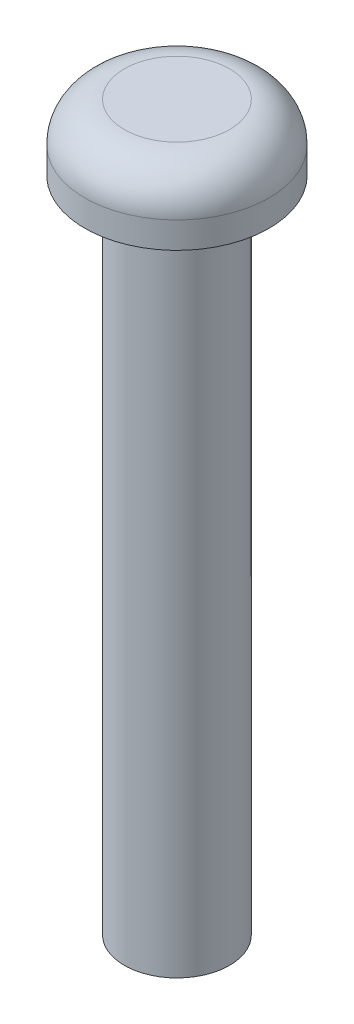
ISO-10303-21;
HEADER;
FILE_DESCRIPTION(('STEP AP214'),'2;1');
FILE_NAME('part.step','',(''),(''),'','','');
FILE_SCHEMA(('AUTOMOTIVE_DESIGN { 1 0 10303 214 1 1 1 1 }'));
ENDSEC;
DATA;
#1=APPLICATION_CONTEXT('core data for automotive mechanical design processes');
#2=APPLICATION_PROTOCOL_DEFINITION('international standard','automotive_design',2000,#1);
#3=PRODUCT_CONTEXT('',#1,'mechanical');
#4=PRODUCT('Part','Part','',(#3));
#5=PRODUCT_RELATED_PRODUCT_CATEGORY('part','',(#4));
#6=PRODUCT_DEFINITION_FORMATION('','',#4);
#7=PRODUCT_DEFINITION_CONTEXT('part definition',#1,'design');
#8=PRODUCT_DEFINITION('design','',#6,#7);
#9=PRODUCT_DEFINITION_SHAPE('','',#8);
#10=(LENGTH_UNIT() NAMED_UNIT(*) SI_UNIT(.MILLI.,.METRE.));
#11=(NAMED_UNIT(*) PLANE_ANGLE_UNIT() SI_UNIT($,.RADIAN.));
#12=(NAMED_UNIT(*) SI_UNIT($,.STERADIAN.) SOLID_ANGLE_UNIT());
#13=UNCERTAINTY_MEASURE_WITH_UNIT(LENGTH_MEASURE(1.E-05),#10,'distance_accuracy_value','');
#14=(GEOMETRIC_REPRESENTATION_CONTEXT(3) GLOBAL_UNCERTAINTY_ASSIGNED_CONTEXT((#13)) GLOBAL_UNIT_ASSIGNED_CONTEXT((#10,
#11,#12)) REPRESENTATION_CONTEXT('',''));
#15=CARTESIAN_POINT('',(0.,0.,0.));
#16=DIRECTION('',(0.,0.,1.));
#17=DIRECTION('',(1.,0.,0.));
#18=AXIS2_PLACEMENT_3D('',#15,#16,#17);
#19=CARTESIAN_POINT('',(0.,-25.,0.));
#20=DIRECTION('',(0.,-1.,0.));
#21=DIRECTION('',(0.,0.,-1.));
#22=AXIS2_PLACEMENT_3D('',#19,#20,#21);
#23=CYLINDRICAL_SURFACE('',#22,2.);
#24=CARTESIAN_POINT('',(0.,0.,0.));
#25=DIRECTION('',(0.,-1.,0.));
#26=DIRECTION('',(0.,0.,-1.));
#27=AXIS2_PLACEMENT_3D('',#24,#25,#26);
#28=CIRCLE('',#27,2.);
#29=CARTESIAN_POINT('',(0.,0.,-2.));
#30=VERTEX_POINT('',#29);
#31=EDGE_CURVE('E10',#30,#30,#28,.T.);
#32=ORIENTED_EDGE('',*,*,#31,.T.);
#33=EDGE_LOOP('',(#32));
#34=FACE_BOUND('',#33,.T.);
#35=CARTESIAN_POINT('',(0.,-25.,0.));
#36=DIRECTION('',(0.,-1.,0.));
#37=DIRECTION('',(0.,0.,-1.));
#38=AXIS2_PLACEMENT_3D('',#35,#36,#37);
#39=CIRCLE('',#38,2.);
#40=CARTESIAN_POINT('',(0.,-25.,-2.));
#41=VERTEX_POINT('',#40);
#42=EDGE_CURVE('E53',#41,#41,#39,.T.);
#43=ORIENTED_EDGE('',*,*,#42,.F.);
#44=EDGE_LOOP('',(#43));
#45=FACE_BOUND('',#44,.T.);
#46=ADVANCED_FACE('F34',(#34,#45),#23,.T.);
#47=CARTESIAN_POINT('',(2.,0.,0.));
#48=DIRECTION('',(0.,-1.,0.));
#49=DIRECTION('',(0.,0.,-1.));
#50=AXIS2_PLACEMENT_3D('',#47,#48,#49);
#51=PLANE('',#50);
#52=CARTESIAN_POINT('',(0.,0.,0.));
#53=DIRECTION('',(0.,-1.,0.));
#54=DIRECTION('',(0.,0.,-1.));
#55=AXIS2_PLACEMENT_3D('',#52,#53,#54);
#56=CIRCLE('',#55,3.5);
#57=CARTESIAN_POINT('',(0.,0.,-3.5));
#58=VERTEX_POINT('',#57);
#59=EDGE_CURVE('E40',#58,#58,#56,.T.);
#60=ORIENTED_EDGE('',*,*,#59,.T.);
#61=EDGE_LOOP('',(#60));
#62=FACE_BOUND('',#61,.T.);
#63=ORIENTED_EDGE('',*,*,#31,.F.);
#64=EDGE_LOOP('',(#63));
#65=FACE_BOUND('',#64,.T.);
#66=ADVANCED_FACE('F60',(#62,#65),#51,.T.);
#67=CARTESIAN_POINT('',(0.,-25.,0.));
#68=DIRECTION('',(0.,-1.,0.));
#69=DIRECTION('',(0.,0.,-1.));
#70=AXIS2_PLACEMENT_3D('',#67,#68,#69);
#71=CYLINDRICAL_SURFACE('',#70,3.5);
#72=CARTESIAN_POINT('',(0.,1.,0.));
#73=DIRECTION('',(0.,-1.,0.));
#74=DIRECTION('',(0.,0.,-1.));
#75=AXIS2_PLACEMENT_3D('',#72,#73,#74);
#76=CIRCLE('',#75,3.5);
#77=CARTESIAN_POINT('',(0.,1.,-3.5));
#78=VERTEX_POINT('',#77);
#79=EDGE_CURVE('E44',#78,#78,#76,.T.);
#80=ORIENTED_EDGE('',*,*,#79,.T.);
#81=EDGE_LOOP('',(#80));
#82=FACE_BOUND('',#81,.T.);
#83=ORIENTED_EDGE('',*,*,#59,.F.);
#84=EDGE_LOOP('',(#83));
#85=FACE_BOUND('',#84,.T.);
#86=ADVANCED_FACE('F64',(#82,#85),#71,.T.);
#87=CARTESIAN_POINT('',(0.,1.,0.));
#88=DIRECTION('',(0.,-1.,0.));
#89=DIRECTION('',(0.,0.,-1.));
#90=AXIS2_PLACEMENT_3D('',#87,#88,#89);
#91=TOROIDAL_SURFACE('',#90,2.,1.5);
#92=CARTESIAN_POINT('',(0.,2.5,0.));
#93=DIRECTION('',(0.,-1.,0.));
#94=DIRECTION('',(0.,0.,-1.));
#95=AXIS2_PLACEMENT_3D('',#92,#93,#94);
#96=CIRCLE('',#95,2.);
#97=CARTESIAN_POINT('',(0.,2.5,-2.));
#98=VERTEX_POINT('',#97);
#99=EDGE_CURVE('E48',#98,#98,#96,.T.);
#100=ORIENTED_EDGE('',*,*,#99,.T.);
#101=EDGE_LOOP('',(#100));
#102=FACE_BOUND('',#101,.T.);
#103=ORIENTED_EDGE('',*,*,#79,.F.);
#104=EDGE_LOOP('',(#103));
#105=FACE_BOUND('',#104,.T.);
#106=ADVANCED_FACE('F68',(#102,#105),#91,.T.);
#107=CARTESIAN_POINT('',(2.,2.5,0.));
#108=DIRECTION('',(0.,1.,0.));
#109=DIRECTION('',(0.,0.,1.));
#110=AXIS2_PLACEMENT_3D('',#107,#108,#109);
#111=PLANE('',#110);
#112=ORIENTED_EDGE('',*,*,#99,.F.);
#113=EDGE_LOOP('',(#112));
#114=FACE_BOUND('',#113,.T.);
#115=ADVANCED_FACE('F75',(#114),#111,.T.);
#116=CARTESIAN_POINT('',(2.,-25.,0.));
#117=DIRECTION('',(0.,-1.,0.));
#118=DIRECTION('',(0.,0.,-1.));
#119=AXIS2_PLACEMENT_3D('',#116,#117,#118);
#120=PLANE('',#119);
#121=ORIENTED_EDGE('',*,*,#42,.T.);
#122=EDGE_LOOP('',(#121));
#123=FACE_BOUND('',#122,.T.);
#124=ADVANCED_FACE('F57',(#123),#120,.T.);
#125=CLOSED_SHELL('',(#46,#66,#86,#106,#115,#124));
#126=MANIFOLD_SOLID_BREP('B2',#125);
#127=ADVANCED_BREP_SHAPE_REPRESENTATION('',(#18,#126),#14);
#128=SHAPE_DEFINITION_REPRESENTATION(#9,#127);
ENDSEC;
END-ISO-10303-21;
